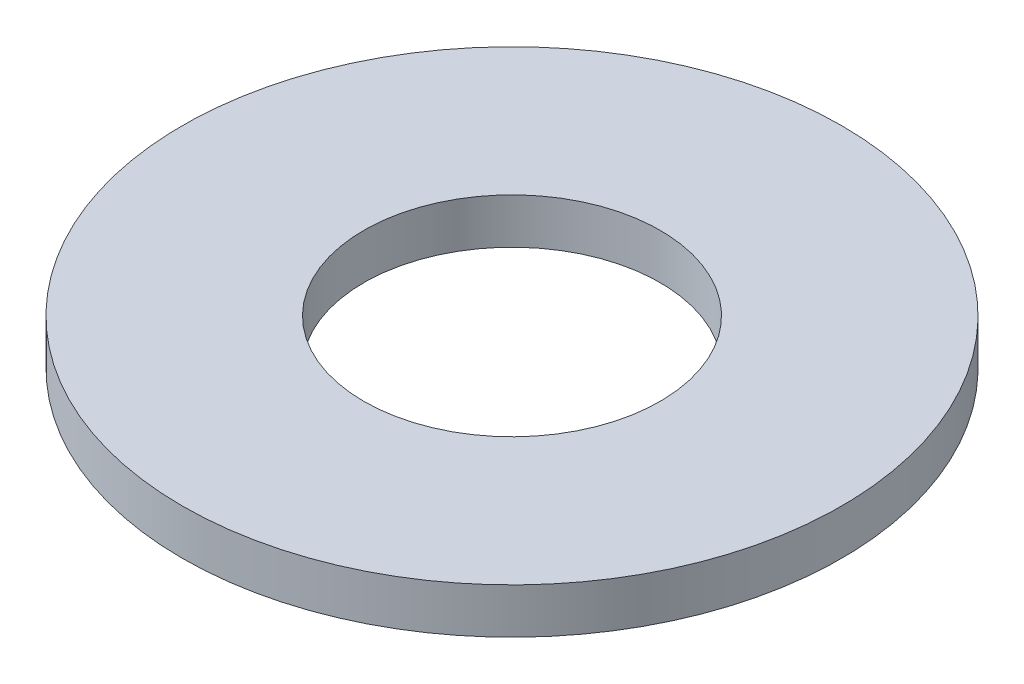
ISO-10303-21;
HEADER;
FILE_DESCRIPTION(('STEP AP214'),'2;1');
FILE_NAME('part.step','',(''),(''),'','','');
FILE_SCHEMA(('AUTOMOTIVE_DESIGN { 1 0 10303 214 1 1 1 1 }'));
ENDSEC;
DATA;
#1=APPLICATION_CONTEXT('core data for automotive mechanical design processes');
#2=APPLICATION_PROTOCOL_DEFINITION('international standard','automotive_design',2000,#1);
#3=PRODUCT_CONTEXT('',#1,'mechanical');
#4=PRODUCT('Part','Part','',(#3));
#5=PRODUCT_RELATED_PRODUCT_CATEGORY('part','',(#4));
#6=PRODUCT_DEFINITION_FORMATION('','',#4);
#7=PRODUCT_DEFINITION_CONTEXT('part definition',#1,'design');
#8=PRODUCT_DEFINITION('design','',#6,#7);
#9=PRODUCT_DEFINITION_SHAPE('','',#8);
#10=(LENGTH_UNIT() NAMED_UNIT(*) SI_UNIT(.MILLI.,.METRE.));
#11=(NAMED_UNIT(*) PLANE_ANGLE_UNIT() SI_UNIT($,.RADIAN.));
#12=(NAMED_UNIT(*) SI_UNIT($,.STERADIAN.) SOLID_ANGLE_UNIT());
#13=UNCERTAINTY_MEASURE_WITH_UNIT(LENGTH_MEASURE(1.E-05),#10,'distance_accuracy_value','');
#14=(GEOMETRIC_REPRESENTATION_CONTEXT(3) GLOBAL_UNCERTAINTY_ASSIGNED_CONTEXT((#13)) GLOBAL_UNIT_ASSIGNED_CONTEXT((#10,
#11,#12)) REPRESENTATION_CONTEXT('',''));
#15=CARTESIAN_POINT('',(0.,0.,0.));
#16=DIRECTION('',(0.,0.,1.));
#17=DIRECTION('',(1.,0.,0.));
#18=AXIS2_PLACEMENT_3D('',#15,#16,#17);
#19=CARTESIAN_POINT('',(0.,0.,0.));
#20=DIRECTION('',(0.,1.,0.));
#21=DIRECTION('',(0.,0.,1.));
#22=AXIS2_PLACEMENT_3D('',#19,#20,#21);
#23=PLANE('',#22);
#24=CARTESIAN_POINT('',(0.,0.,0.));
#25=DIRECTION('',(0.,1.,0.));
#26=DIRECTION('',(0.,0.,1.));
#27=AXIS2_PLACEMENT_3D('',#24,#25,#26);
#28=CIRCLE('',#27,3.5687);
#29=CARTESIAN_POINT('',(0.,0.,3.5687));
#30=VERTEX_POINT('',#29);
#31=EDGE_CURVE('E27',#30,#30,#28,.T.);
#32=ORIENTED_EDGE('',*,*,#31,.T.);
#33=EDGE_LOOP('',(#32));
#34=FACE_BOUND('',#33,.T.);
#35=CARTESIAN_POINT('',(0.,1.60932682111148E-10,0.));
#36=DIRECTION('',(0.,-1.,0.));
#37=DIRECTION('',(0.,0.,-1.));
#38=AXIS2_PLACEMENT_3D('',#35,#36,#37);
#39=CIRCLE('',#38,7.9375);
#40=CARTESIAN_POINT('',(0.,1.60932682111148E-10,-7.9375));
#41=VERTEX_POINT('',#40);
#42=EDGE_CURVE('E18',#41,#41,#39,.F.);
#43=ORIENTED_EDGE('',*,*,#42,.F.);
#44=EDGE_LOOP('',(#43));
#45=FACE_BOUND('',#44,.T.);
#46=ADVANCED_FACE('F15',(#34,#45),#23,.F.);
#47=CARTESIAN_POINT('',(0.,1.0922,0.));
#48=DIRECTION('',(0.,-1.,0.));
#49=DIRECTION('',(0.,0.,-1.));
#50=AXIS2_PLACEMENT_3D('',#47,#48,#49);
#51=CYLINDRICAL_SURFACE('',#50,7.9375);
#52=ORIENTED_EDGE('',*,*,#42,.T.);
#53=EDGE_LOOP('',(#52));
#54=FACE_BOUND('',#53,.T.);
#55=CARTESIAN_POINT('',(0.,1.0922,0.));
#56=DIRECTION('',(0.,-1.,0.));
#57=DIRECTION('',(0.,0.,-1.));
#58=AXIS2_PLACEMENT_3D('',#55,#56,#57);
#59=CIRCLE('',#58,7.9375);
#60=CARTESIAN_POINT('',(0.,1.0922,-7.9375));
#61=VERTEX_POINT('',#60);
#62=EDGE_CURVE('E22',#61,#61,#59,.F.);
#63=ORIENTED_EDGE('',*,*,#62,.F.);
#64=EDGE_LOOP('',(#63));
#65=FACE_BOUND('',#64,.T.);
#66=ADVANCED_FACE('F35',(#54,#65),#51,.T.);
#67=CARTESIAN_POINT('',(0.,0.,0.));
#68=DIRECTION('',(0.,1.,0.));
#69=DIRECTION('',(0.,0.,1.));
#70=AXIS2_PLACEMENT_3D('',#67,#68,#69);
#71=CYLINDRICAL_SURFACE('',#70,3.5687);
#72=CARTESIAN_POINT('',(0.,1.0922,0.));
#73=DIRECTION('',(0.,1.,0.));
#74=DIRECTION('',(0.,0.,1.));
#75=AXIS2_PLACEMENT_3D('',#72,#73,#74);
#76=CIRCLE('',#75,3.5687);
#77=CARTESIAN_POINT('',(0.,1.0922,3.5687));
#78=VERTEX_POINT('',#77);
#79=EDGE_CURVE('E10',#78,#78,#76,.F.);
#80=ORIENTED_EDGE('',*,*,#79,.F.);
#81=EDGE_LOOP('',(#80));
#82=FACE_BOUND('',#81,.T.);
#83=ORIENTED_EDGE('',*,*,#31,.F.);
#84=EDGE_LOOP('',(#83));
#85=FACE_BOUND('',#84,.T.);
#86=ADVANCED_FACE('F43',(#82,#85),#71,.F.);
#87=CARTESIAN_POINT('',(0.,1.0922,0.));
#88=DIRECTION('',(0.,1.,0.));
#89=DIRECTION('',(0.,0.,1.));
#90=AXIS2_PLACEMENT_3D('',#87,#88,#89);
#91=PLANE('',#90);
#92=ORIENTED_EDGE('',*,*,#79,.T.);
#93=EDGE_LOOP('',(#92));
#94=FACE_BOUND('',#93,.T.);
#95=ORIENTED_EDGE('',*,*,#62,.T.);
#96=EDGE_LOOP('',(#95));
#97=FACE_BOUND('',#96,.T.);
#98=ADVANCED_FACE('F44',(#94,#97),#91,.T.);
#99=CLOSED_SHELL('',(#46,#66,#86,#98));
#100=MANIFOLD_SOLID_BREP('B1',#99);
#101=ADVANCED_BREP_SHAPE_REPRESENTATION('',(#18,#100),#14);
#102=SHAPE_DEFINITION_REPRESENTATION(#9,#101);
ENDSEC;
END-ISO-10303-21;
